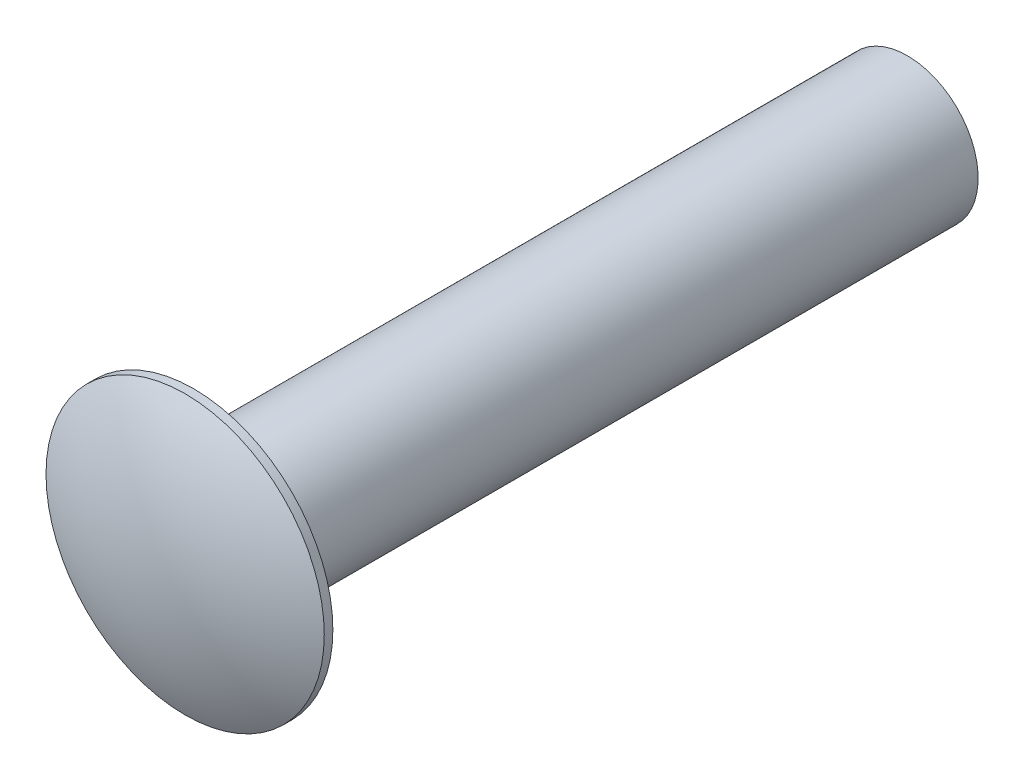
ISO-10303-21;
HEADER;
FILE_DESCRIPTION(('STEP AP214'),'2;1');
FILE_NAME('part.step','',(''),(''),'','','');
FILE_SCHEMA(('AUTOMOTIVE_DESIGN { 1 0 10303 214 1 1 1 1 }'));
ENDSEC;
DATA;
#1=APPLICATION_CONTEXT('core data for automotive mechanical design processes');
#2=APPLICATION_PROTOCOL_DEFINITION('international standard','automotive_design',2000,#1);
#3=PRODUCT_CONTEXT('',#1,'mechanical');
#4=PRODUCT('Part','Part','',(#3));
#5=PRODUCT_RELATED_PRODUCT_CATEGORY('part','',(#4));
#6=PRODUCT_DEFINITION_FORMATION('','',#4);
#7=PRODUCT_DEFINITION_CONTEXT('part definition',#1,'design');
#8=PRODUCT_DEFINITION('design','',#6,#7);
#9=PRODUCT_DEFINITION_SHAPE('','',#8);
#10=(LENGTH_UNIT() NAMED_UNIT(*) SI_UNIT(.MILLI.,.METRE.));
#11=(NAMED_UNIT(*) PLANE_ANGLE_UNIT() SI_UNIT($,.RADIAN.));
#12=(NAMED_UNIT(*) SI_UNIT($,.STERADIAN.) SOLID_ANGLE_UNIT());
#13=UNCERTAINTY_MEASURE_WITH_UNIT(LENGTH_MEASURE(1.E-05),#10,'distance_accuracy_value','');
#14=(GEOMETRIC_REPRESENTATION_CONTEXT(3) GLOBAL_UNCERTAINTY_ASSIGNED_CONTEXT((#13)) GLOBAL_UNIT_ASSIGNED_CONTEXT((#10,
#11,#12)) REPRESENTATION_CONTEXT('',''));
#15=CARTESIAN_POINT('',(0.,0.,0.));
#16=DIRECTION('',(0.,0.,1.));
#17=DIRECTION('',(1.,0.,0.));
#18=AXIS2_PLACEMENT_3D('',#15,#16,#17);
#19=CARTESIAN_POINT('',(34.0359999999938,20.0660000000007,8.36002510475947));
#20=DIRECTION('',(0.,0.,-1.));
#21=DIRECTION('',(-3.0272510589989E-13,-1.,0.));
#22=AXIS2_PLACEMENT_3D('',#19,#20,#21);
#23=SPHERICAL_SURFACE('',#22,5.07657489524061);
#24=CARTESIAN_POINT('',(34.036,20.0660000000004,12.8468349577611));
#25=DIRECTION('',(0.,0.,-1.));
#26=DIRECTION('',(-1.,0.,0.));
#27=AXIS2_PLACEMENT_3D('',#24,#25,#26);
#28=CIRCLE('',#27,2.37490000000006);
#29=CARTESIAN_POINT('',(31.6610999999999,20.0660000000004,12.8468349577613));
#30=VERTEX_POINT('',#29);
#31=EDGE_CURVE('E31',#30,#30,#28,.T.);
#32=ORIENTED_EDGE('',*,*,#31,.F.);
#33=EDGE_LOOP('',(#32));
#34=FACE_BOUND('',#33,.T.);
#35=ADVANCED_FACE('F15',(#34),#23,.T.);
#36=CARTESIAN_POINT('',(34.902774935275,19.199225064725,2.47340000000001));
#37=DIRECTION('',(0.,0.,1.));
#38=DIRECTION('',(0.,1.,0.));
#39=AXIS2_PLACEMENT_3D('',#36,#37,#38);
#40=PLANE('',#39);
#41=CARTESIAN_POINT('',(34.036,20.0659999999999,2.47340000000001));
#42=DIRECTION('',(0.,0.,1.));
#43=DIRECTION('',(1.,0.,0.));
#44=AXIS2_PLACEMENT_3D('',#41,#42,#43);
#45=CIRCLE('',#44,0.825499999999989);
#46=CARTESIAN_POINT('',(34.8615,20.0659999999999,2.47340000000001));
#47=VERTEX_POINT('',#46);
#48=EDGE_CURVE('E19',#47,#47,#45,.F.);
#49=ORIENTED_EDGE('',*,*,#48,.T.);
#50=EDGE_LOOP('',(#49));
#51=FACE_BOUND('',#50,.T.);
#52=ADVANCED_FACE('F48',(#51),#40,.F.);
#53=CARTESIAN_POINT('',(34.036,20.0660000000004,12.8468349577611));
#54=DIRECTION('',(0.,0.,-1.));
#55=DIRECTION('',(-1.,0.,0.));
#56=AXIS2_PLACEMENT_3D('',#53,#54,#55);
#57=CYLINDRICAL_SURFACE('',#56,2.37490000000006);
#58=ORIENTED_EDGE('',*,*,#31,.T.);
#59=EDGE_LOOP('',(#58));
#60=FACE_BOUND('',#59,.T.);
#61=CARTESIAN_POINT('',(34.036,20.0660000000004,12.7000000000001));
#62=DIRECTION('',(0.,0.,-1.));
#63=DIRECTION('',(-1.,0.,0.));
#64=AXIS2_PLACEMENT_3D('',#61,#62,#63);
#65=CIRCLE('',#64,2.37490000000006);
#66=CARTESIAN_POINT('',(31.6610999999999,20.0660000000004,12.7000000000003));
#67=VERTEX_POINT('',#66);
#68=EDGE_CURVE('E34',#67,#67,#65,.T.);
#69=ORIENTED_EDGE('',*,*,#68,.F.);
#70=EDGE_LOOP('',(#69));
#71=FACE_BOUND('',#70,.T.);
#72=ADVANCED_FACE('F44',(#60,#71),#57,.T.);
#73=CARTESIAN_POINT('',(34.036,20.0659999999999,0.517600000000012));
#74=DIRECTION('',(0.,0.,1.));
#75=DIRECTION('',(1.,0.,0.));
#76=AXIS2_PLACEMENT_3D('',#73,#74,#75);
#77=CYLINDRICAL_SURFACE('',#76,0.825499999999989);
#78=ORIENTED_EDGE('',*,*,#48,.F.);
#79=EDGE_LOOP('',(#78));
#80=FACE_BOUND('',#79,.T.);
#81=CARTESIAN_POINT('',(34.036,20.0659999999999,0.517600000000012));
#82=DIRECTION('',(0.,0.,1.));
#83=DIRECTION('',(1.,0.,0.));
#84=AXIS2_PLACEMENT_3D('',#81,#82,#83);
#85=CIRCLE('',#84,0.825499999999989);
#86=CARTESIAN_POINT('',(34.8615,20.0659999999999,0.517600000000012));
#87=VERTEX_POINT('',#86);
#88=EDGE_CURVE('E28',#87,#87,#85,.T.);
#89=ORIENTED_EDGE('',*,*,#88,.F.);
#90=EDGE_LOOP('',(#89));
#91=FACE_BOUND('',#90,.T.);
#92=ADVANCED_FACE('F66',(#80,#91),#77,.F.);
#93=CARTESIAN_POINT('',(31.42361,17.45361,12.7));
#94=DIRECTION('',(0.,0.,-1.));
#95=DIRECTION('',(0.,1.,0.));
#96=AXIS2_PLACEMENT_3D('',#93,#94,#95);
#97=PLANE('',#96);
#98=CARTESIAN_POINT('',(34.036,20.0660000000001,12.7));
#99=DIRECTION('',(0.,0.,-1.));
#100=DIRECTION('',(-1.,0.,0.));
#101=AXIS2_PLACEMENT_3D('',#98,#99,#100);
#102=CIRCLE('',#101,1.20650000000002);
#103=CARTESIAN_POINT('',(32.8295,20.0660000000001,12.7));
#104=VERTEX_POINT('',#103);
#105=EDGE_CURVE('E23',#104,#104,#102,.T.);
#106=ORIENTED_EDGE('',*,*,#105,.F.);
#107=EDGE_LOOP('',(#106));
#108=FACE_BOUND('',#107,.T.);
#109=ORIENTED_EDGE('',*,*,#68,.T.);
#110=EDGE_LOOP('',(#109));
#111=FACE_BOUND('',#110,.T.);
#112=ADVANCED_FACE('F61',(#108,#111),#97,.T.);
#113=CARTESIAN_POINT('',(32.70885,18.73885,0.517600000000012));
#114=DIRECTION('',(0.,0.,-1.));
#115=DIRECTION('',(0.,1.,0.));
#116=AXIS2_PLACEMENT_3D('',#113,#114,#115);
#117=PLANE('',#116);
#118=ORIENTED_EDGE('',*,*,#88,.T.);
#119=EDGE_LOOP('',(#118));
#120=FACE_BOUND('',#119,.T.);
#121=CARTESIAN_POINT('',(34.036,20.0660000000001,0.517600000000012));
#122=DIRECTION('',(0.,0.,-1.));
#123=DIRECTION('',(-1.,0.,0.));
#124=AXIS2_PLACEMENT_3D('',#121,#122,#123);
#125=CIRCLE('',#124,1.20650000000002);
#126=CARTESIAN_POINT('',(32.8295,20.0660000000001,0.517600000000012));
#127=VERTEX_POINT('',#126);
#128=EDGE_CURVE('E10',#127,#127,#125,.F.);
#129=ORIENTED_EDGE('',*,*,#128,.F.);
#130=EDGE_LOOP('',(#129));
#131=FACE_BOUND('',#130,.T.);
#132=ADVANCED_FACE('F56',(#120,#131),#117,.T.);
#133=CARTESIAN_POINT('',(34.036,20.0660000000001,12.7));
#134=DIRECTION('',(0.,0.,-1.));
#135=DIRECTION('',(-1.,0.,0.));
#136=AXIS2_PLACEMENT_3D('',#133,#134,#135);
#137=CYLINDRICAL_SURFACE('',#136,1.20650000000002);
#138=ORIENTED_EDGE('',*,*,#105,.T.);
#139=EDGE_LOOP('',(#138));
#140=FACE_BOUND('',#139,.T.);
#141=ORIENTED_EDGE('',*,*,#128,.T.);
#142=EDGE_LOOP('',(#141));
#143=FACE_BOUND('',#142,.T.);
#144=ADVANCED_FACE('F17',(#140,#143),#137,.T.);
#145=CLOSED_SHELL('',(#35,#52,#72,#92,#112,#132,#144));
#146=MANIFOLD_SOLID_BREP('B1',#145);
#147=ADVANCED_BREP_SHAPE_REPRESENTATION('',(#18,#146),#14);
#148=SHAPE_DEFINITION_REPRESENTATION(#9,#147);
ENDSEC;
END-ISO-10303-21;
